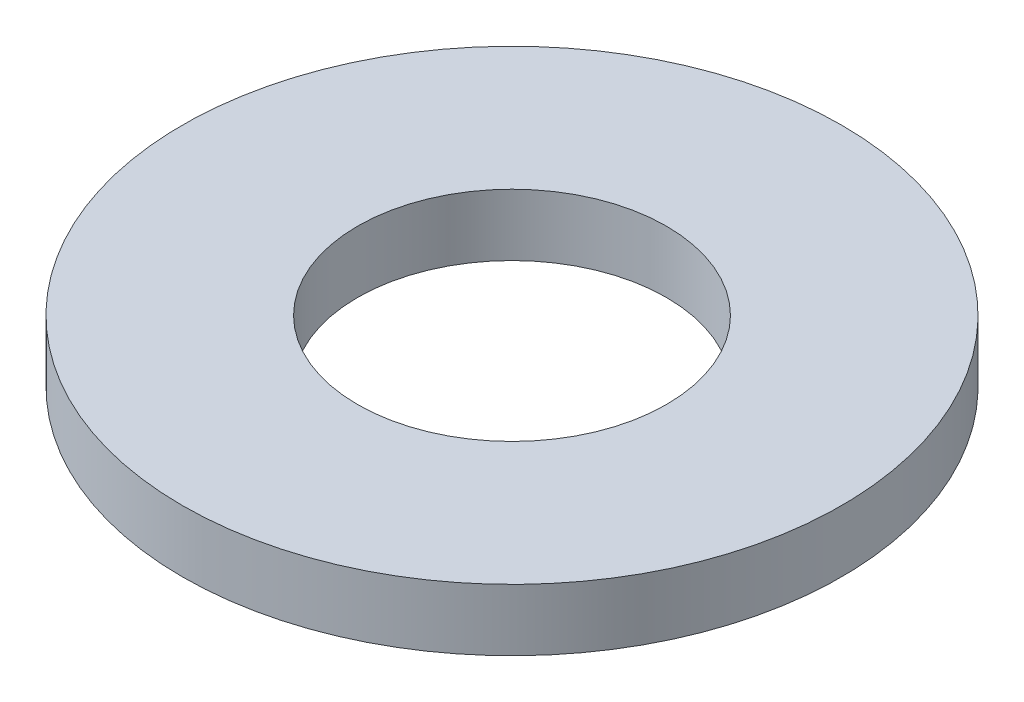
ISO-10303-21;
HEADER;
FILE_DESCRIPTION(('STEP AP214'),'2;1');
FILE_NAME('part.step','',(''),(''),'','','');
FILE_SCHEMA(('AUTOMOTIVE_DESIGN { 1 0 10303 214 1 1 1 1 }'));
ENDSEC;
DATA;
#1=APPLICATION_CONTEXT('core data for automotive mechanical design processes');
#2=APPLICATION_PROTOCOL_DEFINITION('international standard','automotive_design',2000,#1);
#3=PRODUCT_CONTEXT('',#1,'mechanical');
#4=PRODUCT('Part','Part','',(#3));
#5=PRODUCT_RELATED_PRODUCT_CATEGORY('part','',(#4));
#6=PRODUCT_DEFINITION_FORMATION('','',#4);
#7=PRODUCT_DEFINITION_CONTEXT('part definition',#1,'design');
#8=PRODUCT_DEFINITION('design','',#6,#7);
#9=PRODUCT_DEFINITION_SHAPE('','',#8);
#10=(LENGTH_UNIT() NAMED_UNIT(*) SI_UNIT(.MILLI.,.METRE.));
#11=(NAMED_UNIT(*) PLANE_ANGLE_UNIT() SI_UNIT($,.RADIAN.));
#12=(NAMED_UNIT(*) SI_UNIT($,.STERADIAN.) SOLID_ANGLE_UNIT());
#13=UNCERTAINTY_MEASURE_WITH_UNIT(LENGTH_MEASURE(1.E-05),#10,'distance_accuracy_value','');
#14=(GEOMETRIC_REPRESENTATION_CONTEXT(3) GLOBAL_UNCERTAINTY_ASSIGNED_CONTEXT((#13)) GLOBAL_UNIT_ASSIGNED_CONTEXT((#10,
#11,#12)) REPRESENTATION_CONTEXT('',''));
#15=CARTESIAN_POINT('',(0.,0.,0.));
#16=DIRECTION('',(0.,0.,1.));
#17=DIRECTION('',(1.,0.,0.));
#18=AXIS2_PLACEMENT_3D('',#15,#16,#17);
#19=CARTESIAN_POINT('',(0.,15.,0.));
#20=DIRECTION('',(0.,-1.,0.));
#21=DIRECTION('',(0.,0.,-1.));
#22=AXIS2_PLACEMENT_3D('',#19,#20,#21);
#23=CYLINDRICAL_SURFACE('',#22,80.);
#24=CARTESIAN_POINT('',(0.,15.,0.));
#25=DIRECTION('',(0.,1.,0.));
#26=DIRECTION('',(0.,0.,1.));
#27=AXIS2_PLACEMENT_3D('',#24,#25,#26);
#28=CIRCLE('',#27,80.);
#29=CARTESIAN_POINT('',(0.,15.,80.));
#30=VERTEX_POINT('',#29);
#31=EDGE_CURVE('E10',#30,#30,#28,.T.);
#32=ORIENTED_EDGE('',*,*,#31,.F.);
#33=EDGE_LOOP('',(#32));
#34=FACE_BOUND('',#33,.T.);
#35=CARTESIAN_POINT('',(0.,0.,0.));
#36=DIRECTION('',(0.,1.,0.));
#37=DIRECTION('',(0.,0.,1.));
#38=AXIS2_PLACEMENT_3D('',#35,#36,#37);
#39=CIRCLE('',#38,80.);
#40=CARTESIAN_POINT('',(0.,0.,80.));
#41=VERTEX_POINT('',#40);
#42=EDGE_CURVE('E37',#41,#41,#39,.T.);
#43=ORIENTED_EDGE('',*,*,#42,.T.);
#44=EDGE_LOOP('',(#43));
#45=FACE_BOUND('',#44,.T.);
#46=ADVANCED_FACE('F40',(#34,#45),#23,.T.);
#47=CARTESIAN_POINT('',(0.,15.,0.));
#48=DIRECTION('',(0.,1.,0.));
#49=DIRECTION('',(0.,0.,1.));
#50=AXIS2_PLACEMENT_3D('',#47,#48,#49);
#51=PLANE('',#50);
#52=CARTESIAN_POINT('',(0.,15.,0.));
#53=DIRECTION('',(0.,1.,0.));
#54=DIRECTION('',(0.,0.,1.));
#55=AXIS2_PLACEMENT_3D('',#52,#53,#54);
#56=CIRCLE('',#55,37.5);
#57=CARTESIAN_POINT('',(0.,15.,37.5));
#58=VERTEX_POINT('',#57);
#59=EDGE_CURVE('E50',#58,#58,#56,.T.);
#60=ORIENTED_EDGE('',*,*,#59,.F.);
#61=EDGE_LOOP('',(#60));
#62=FACE_BOUND('',#61,.T.);
#63=ORIENTED_EDGE('',*,*,#31,.T.);
#64=EDGE_LOOP('',(#63));
#65=FACE_BOUND('',#64,.T.);
#66=ADVANCED_FACE('F59',(#62,#65),#51,.T.);
#67=CARTESIAN_POINT('',(0.,0.,0.));
#68=DIRECTION('',(0.,1.,0.));
#69=DIRECTION('',(0.,0.,1.));
#70=AXIS2_PLACEMENT_3D('',#67,#68,#69);
#71=PLANE('',#70);
#72=CARTESIAN_POINT('',(0.,0.,0.));
#73=DIRECTION('',(0.,1.,0.));
#74=DIRECTION('',(0.,0.,1.));
#75=AXIS2_PLACEMENT_3D('',#72,#73,#74);
#76=CIRCLE('',#75,37.5);
#77=CARTESIAN_POINT('',(0.,0.,37.5));
#78=VERTEX_POINT('',#77);
#79=EDGE_CURVE('E47',#78,#78,#76,.T.);
#80=ORIENTED_EDGE('',*,*,#79,.T.);
#81=EDGE_LOOP('',(#80));
#82=FACE_BOUND('',#81,.T.);
#83=ORIENTED_EDGE('',*,*,#42,.F.);
#84=EDGE_LOOP('',(#83));
#85=FACE_BOUND('',#84,.T.);
#86=ADVANCED_FACE('F58',(#82,#85),#71,.F.);
#87=CARTESIAN_POINT('',(0.,15.,0.));
#88=DIRECTION('',(0.,-1.,0.));
#89=DIRECTION('',(0.,0.,-1.));
#90=AXIS2_PLACEMENT_3D('',#87,#88,#89);
#91=CYLINDRICAL_SURFACE('',#90,37.5);
#92=ORIENTED_EDGE('',*,*,#59,.T.);
#93=EDGE_LOOP('',(#92));
#94=FACE_BOUND('',#93,.T.);
#95=ORIENTED_EDGE('',*,*,#79,.F.);
#96=EDGE_LOOP('',(#95));
#97=FACE_BOUND('',#96,.T.);
#98=ADVANCED_FACE('F54',(#94,#97),#91,.F.);
#99=CLOSED_SHELL('',(#46,#66,#86,#98));
#100=MANIFOLD_SOLID_BREP('B2',#99);
#101=ADVANCED_BREP_SHAPE_REPRESENTATION('',(#18,#100),#14);
#102=SHAPE_DEFINITION_REPRESENTATION(#9,#101);
ENDSEC;
END-ISO-10303-21;
